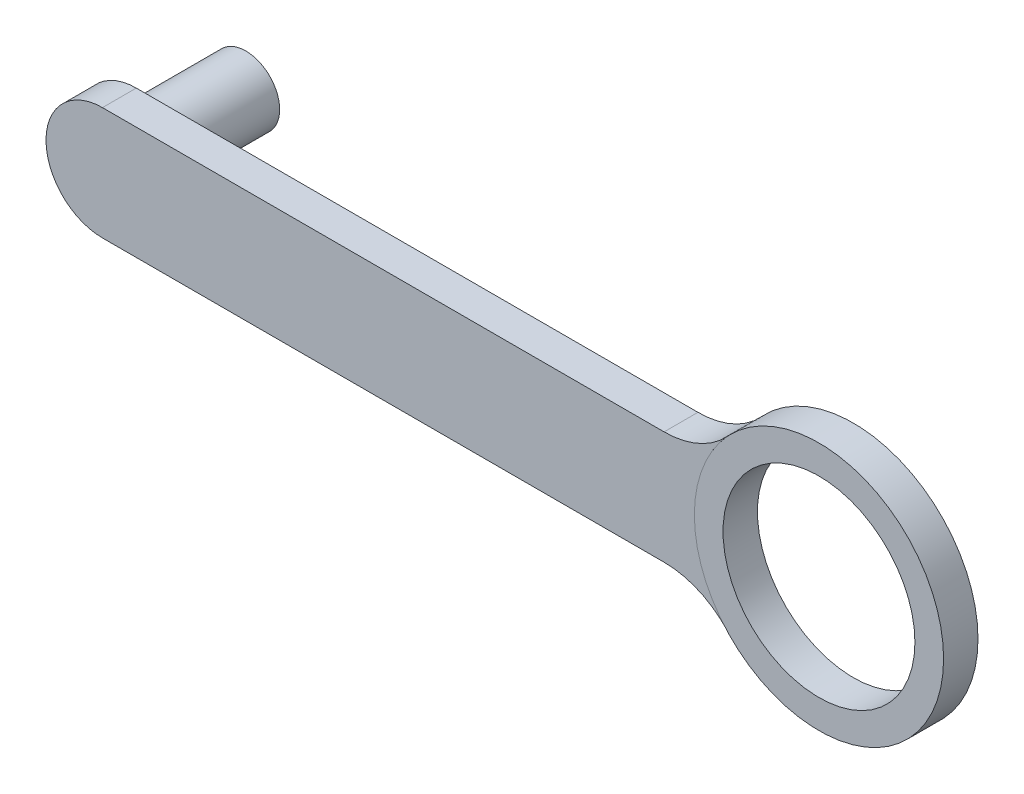
ISO-10303-21;
HEADER;
FILE_DESCRIPTION(('STEP AP214'),'2;1');
FILE_NAME('part.step','',(''),(''),'','','');
FILE_SCHEMA(('AUTOMOTIVE_DESIGN { 1 0 10303 214 1 1 1 1 }'));
ENDSEC;
DATA;
#1=APPLICATION_CONTEXT('core data for automotive mechanical design processes');
#2=APPLICATION_PROTOCOL_DEFINITION('international standard','automotive_design',2000,#1);
#3=PRODUCT_CONTEXT('',#1,'mechanical');
#4=PRODUCT('Part','Part','',(#3));
#5=PRODUCT_RELATED_PRODUCT_CATEGORY('part','',(#4));
#6=PRODUCT_DEFINITION_FORMATION('','',#4);
#7=PRODUCT_DEFINITION_CONTEXT('part definition',#1,'design');
#8=PRODUCT_DEFINITION('design','',#6,#7);
#9=PRODUCT_DEFINITION_SHAPE('','',#8);
#10=(LENGTH_UNIT() NAMED_UNIT(*) SI_UNIT(.MILLI.,.METRE.));
#11=(NAMED_UNIT(*) PLANE_ANGLE_UNIT() SI_UNIT($,.RADIAN.));
#12=(NAMED_UNIT(*) SI_UNIT($,.STERADIAN.) SOLID_ANGLE_UNIT());
#13=UNCERTAINTY_MEASURE_WITH_UNIT(LENGTH_MEASURE(1.E-05),#10,'distance_accuracy_value','');
#14=(GEOMETRIC_REPRESENTATION_CONTEXT(3) GLOBAL_UNCERTAINTY_ASSIGNED_CONTEXT((#13)) GLOBAL_UNIT_ASSIGNED_CONTEXT((#10,
#11,#12)) REPRESENTATION_CONTEXT('',''));
#15=CARTESIAN_POINT('',(0.,0.,0.));
#16=DIRECTION('',(0.,0.,1.));
#17=DIRECTION('',(1.,0.,0.));
#18=AXIS2_PLACEMENT_3D('',#15,#16,#17);
#19=CARTESIAN_POINT('',(-31.75,0.,1.5));
#20=DIRECTION('',(0.,0.,1.));
#21=DIRECTION('',(1.,0.,0.));
#22=AXIS2_PLACEMENT_3D('',#19,#20,#21);
#23=PLANE('',#22);
#24=CARTESIAN_POINT('',(31.75,0.,1.5));
#25=DIRECTION('',(0.,0.,1.));
#26=DIRECTION('',(1.,0.,0.));
#27=AXIS2_PLACEMENT_3D('',#24,#25,#26);
#28=CIRCLE('',#27,11.04);
#29=CARTESIAN_POINT('',(23.6177770705611,7.46649517684889,1.5));
#30=VERTEX_POINT('',#29);
#31=CARTESIAN_POINT('',(23.6177770705611,-7.46649517684887,1.5));
#32=VERTEX_POINT('',#31);
#33=EDGE_CURVE('E131',#30,#32,#28,.T.);
#34=ORIENTED_EDGE('',*,*,#33,.F.);
#35=CARTESIAN_POINT('',(18.0047753746983,12.62,1.5));
#36=DIRECTION('',(0.,0.,1.));
#37=DIRECTION('',(1.,0.,0.));
#38=AXIS2_PLACEMENT_3D('',#35,#36,#37);
#39=CIRCLE('',#38,7.62);
#40=CARTESIAN_POINT('',(18.0047753746983,5.00000000000002,1.5));
#41=VERTEX_POINT('',#40);
#42=EDGE_CURVE('E11',#30,#41,#39,.F.);
#43=ORIENTED_EDGE('',*,*,#42,.T.);
#44=DIRECTION('',(-1.,0.,0.));
#45=VECTOR('',#44,1.);
#46=CARTESIAN_POINT('',(-31.75,5.00000000000001,1.5));
#47=LINE('',#46,#45);
#48=CARTESIAN_POINT('',(-31.75,5.00000000000001,1.5));
#49=VERTEX_POINT('',#48);
#50=EDGE_CURVE('E95',#41,#49,#47,.T.);
#51=ORIENTED_EDGE('',*,*,#50,.T.);
#52=CARTESIAN_POINT('',(-31.75,0.,1.5));
#53=DIRECTION('',(0.,0.,1.));
#54=DIRECTION('',(1.,0.,0.));
#55=AXIS2_PLACEMENT_3D('',#52,#53,#54);
#56=CIRCLE('',#55,5.00000000000001);
#57=CARTESIAN_POINT('',(-31.75,-5.00000000000001,1.5));
#58=VERTEX_POINT('',#57);
#59=EDGE_CURVE('E96',#49,#58,#56,.T.);
#60=ORIENTED_EDGE('',*,*,#59,.T.);
#61=DIRECTION('',(1.,0.,0.));
#62=VECTOR('',#61,1.);
#63=CARTESIAN_POINT('',(-31.75,-5.00000000000001,1.5));
#64=LINE('',#63,#62);
#65=CARTESIAN_POINT('',(18.0047753746983,-5.,1.5));
#66=VERTEX_POINT('',#65);
#67=EDGE_CURVE('E85',#58,#66,#64,.T.);
#68=ORIENTED_EDGE('',*,*,#67,.T.);
#69=CARTESIAN_POINT('',(18.0047753746983,-12.62,1.5));
#70=DIRECTION('',(0.,0.,1.));
#71=DIRECTION('',(1.,0.,0.));
#72=AXIS2_PLACEMENT_3D('',#69,#70,#71);
#73=CIRCLE('',#72,7.62);
#74=EDGE_CURVE('E121',#66,#32,#73,.F.);
#75=ORIENTED_EDGE('',*,*,#74,.T.);
#76=EDGE_LOOP('',(#34,#43,#51,#60,#68,#75));
#77=FACE_BOUND('',#76,.T.);
#78=ADVANCED_FACE('F32',(#77),#23,.T.);
#79=CARTESIAN_POINT('',(-31.75,0.,-1.5));
#80=DIRECTION('',(0.,0.,1.));
#81=DIRECTION('',(1.,0.,0.));
#82=AXIS2_PLACEMENT_3D('',#79,#80,#81);
#83=PLANE('',#82);
#84=DIRECTION('',(-1.,0.,0.));
#85=VECTOR('',#84,1.);
#86=CARTESIAN_POINT('',(-31.75,5.00000000000001,-1.5));
#87=LINE('',#86,#85);
#88=CARTESIAN_POINT('',(18.0047753746983,5.00000000000002,-1.5));
#89=VERTEX_POINT('',#88);
#90=CARTESIAN_POINT('',(-31.75,5.00000000000001,-1.5));
#91=VERTEX_POINT('',#90);
#92=EDGE_CURVE('E102',#89,#91,#87,.T.);
#93=ORIENTED_EDGE('',*,*,#92,.F.);
#94=CARTESIAN_POINT('',(18.0047753746983,12.62,-1.5));
#95=DIRECTION('',(0.,0.,1.));
#96=DIRECTION('',(1.,0.,0.));
#97=AXIS2_PLACEMENT_3D('',#94,#95,#96);
#98=CIRCLE('',#97,7.62);
#99=CARTESIAN_POINT('',(23.6177770705611,7.46649517684889,-1.5));
#100=VERTEX_POINT('',#99);
#101=EDGE_CURVE('E40',#89,#100,#98,.T.);
#102=ORIENTED_EDGE('',*,*,#101,.T.);
#103=CARTESIAN_POINT('',(31.75,0.,-1.5));
#104=DIRECTION('',(0.,0.,1.));
#105=DIRECTION('',(1.,0.,0.));
#106=AXIS2_PLACEMENT_3D('',#103,#104,#105);
#107=CIRCLE('',#106,11.04);
#108=CARTESIAN_POINT('',(23.6177770705611,-7.46649517684887,-1.5));
#109=VERTEX_POINT('',#108);
#110=EDGE_CURVE('E128',#100,#109,#107,.T.);
#111=ORIENTED_EDGE('',*,*,#110,.T.);
#112=CARTESIAN_POINT('',(18.0047753746983,-12.62,-1.5));
#113=DIRECTION('',(0.,0.,1.));
#114=DIRECTION('',(1.,0.,0.));
#115=AXIS2_PLACEMENT_3D('',#112,#113,#114);
#116=CIRCLE('',#115,7.62);
#117=CARTESIAN_POINT('',(18.0047753746983,-5.,-1.5));
#118=VERTEX_POINT('',#117);
#119=EDGE_CURVE('E123',#109,#118,#116,.T.);
#120=ORIENTED_EDGE('',*,*,#119,.T.);
#121=DIRECTION('',(1.,0.,0.));
#122=VECTOR('',#121,1.);
#123=CARTESIAN_POINT('',(-31.75,-5.00000000000001,-1.5));
#124=LINE('',#123,#122);
#125=CARTESIAN_POINT('',(-31.75,-5.00000000000001,-1.5));
#126=VERTEX_POINT('',#125);
#127=EDGE_CURVE('E150',#126,#118,#124,.T.);
#128=ORIENTED_EDGE('',*,*,#127,.F.);
#129=CARTESIAN_POINT('',(-31.75,0.,-1.5));
#130=DIRECTION('',(0.,0.,1.));
#131=DIRECTION('',(1.,0.,0.));
#132=AXIS2_PLACEMENT_3D('',#129,#130,#131);
#133=CIRCLE('',#132,5.00000000000001);
#134=EDGE_CURVE('E106',#91,#126,#133,.T.);
#135=ORIENTED_EDGE('',*,*,#134,.F.);
#136=EDGE_LOOP('',(#93,#102,#111,#120,#128,#135));
#137=FACE_BOUND('',#136,.T.);
#138=CARTESIAN_POINT('',(-31.75,0.,-1.5));
#139=DIRECTION('',(0.,0.,1.));
#140=DIRECTION('',(1.,0.,0.));
#141=AXIS2_PLACEMENT_3D('',#138,#139,#140);
#142=CIRCLE('',#141,3.);
#143=CARTESIAN_POINT('',(-28.75,0.,-1.5));
#144=VERTEX_POINT('',#143);
#145=EDGE_CURVE('E145',#144,#144,#142,.T.);
#146=ORIENTED_EDGE('',*,*,#145,.T.);
#147=EDGE_LOOP('',(#146));
#148=FACE_BOUND('',#147,.T.);
#149=ADVANCED_FACE('F126',(#137,#148),#83,.F.);
#150=CARTESIAN_POINT('',(-31.75,0.,1.5));
#151=DIRECTION('',(0.,0.,-1.));
#152=DIRECTION('',(-1.,0.,0.));
#153=AXIS2_PLACEMENT_3D('',#150,#151,#152);
#154=CYLINDRICAL_SURFACE('',#153,5.00000000000001);
#155=ORIENTED_EDGE('',*,*,#134,.T.);
#156=DIRECTION('',(0.,0.,-1.));
#157=VECTOR('',#156,1.);
#158=CARTESIAN_POINT('',(-31.75,-5.00000000000001,1.5));
#159=LINE('',#158,#157);
#160=EDGE_CURVE('E90',#58,#126,#159,.T.);
#161=ORIENTED_EDGE('',*,*,#160,.F.);
#162=ORIENTED_EDGE('',*,*,#59,.F.);
#163=DIRECTION('',(0.,0.,-1.));
#164=VECTOR('',#163,1.);
#165=CARTESIAN_POINT('',(-31.75,5.00000000000001,1.5));
#166=LINE('',#165,#164);
#167=EDGE_CURVE('E107',#49,#91,#166,.T.);
#168=ORIENTED_EDGE('',*,*,#167,.T.);
#169=EDGE_LOOP('',(#155,#161,#162,#168));
#170=FACE_BOUND('',#169,.T.);
#171=ADVANCED_FACE('F104',(#170),#154,.T.);
#172=CARTESIAN_POINT('',(-31.75,-5.00000000000001,1.5));
#173=DIRECTION('',(0.,1.,0.));
#174=DIRECTION('',(-1.,0.,0.));
#175=AXIS2_PLACEMENT_3D('',#172,#173,#174);
#176=PLANE('',#175);
#177=ORIENTED_EDGE('',*,*,#127,.T.);
#178=DIRECTION('',(0.,0.,1.));
#179=VECTOR('',#178,1.);
#180=CARTESIAN_POINT('',(18.0047753746983,-5.,1.5));
#181=LINE('',#180,#179);
#182=EDGE_CURVE('E93',#118,#66,#181,.T.);
#183=ORIENTED_EDGE('',*,*,#182,.T.);
#184=ORIENTED_EDGE('',*,*,#67,.F.);
#185=ORIENTED_EDGE('',*,*,#160,.T.);
#186=EDGE_LOOP('',(#177,#183,#184,#185));
#187=FACE_BOUND('',#186,.T.);
#188=ADVANCED_FACE('F88',(#187),#176,.F.);
#189=CARTESIAN_POINT('',(-31.75,5.00000000000001,1.5));
#190=DIRECTION('',(0.,-1.,0.));
#191=DIRECTION('',(1.,0.,0.));
#192=AXIS2_PLACEMENT_3D('',#189,#190,#191);
#193=PLANE('',#192);
#194=ORIENTED_EDGE('',*,*,#50,.F.);
#195=DIRECTION('',(0.,0.,1.));
#196=VECTOR('',#195,1.);
#197=CARTESIAN_POINT('',(18.0047753746983,5.00000000000002,1.5));
#198=LINE('',#197,#196);
#199=EDGE_CURVE('E119',#41,#89,#198,.F.);
#200=ORIENTED_EDGE('',*,*,#199,.T.);
#201=ORIENTED_EDGE('',*,*,#92,.T.);
#202=ORIENTED_EDGE('',*,*,#167,.F.);
#203=EDGE_LOOP('',(#194,#200,#201,#202));
#204=FACE_BOUND('',#203,.T.);
#205=ADVANCED_FACE('F152',(#204),#193,.F.);
#206=CARTESIAN_POINT('',(-31.75,0.,-11.2));
#207=DIRECTION('',(0.,0.,1.));
#208=DIRECTION('',(1.,0.,0.));
#209=AXIS2_PLACEMENT_3D('',#206,#207,#208);
#210=CYLINDRICAL_SURFACE('',#209,3.);
#211=CARTESIAN_POINT('',(-31.75,0.,-11.2));
#212=DIRECTION('',(0.,0.,1.));
#213=DIRECTION('',(1.,0.,0.));
#214=AXIS2_PLACEMENT_3D('',#211,#212,#213);
#215=CIRCLE('',#214,3.);
#216=CARTESIAN_POINT('',(-28.75,0.,-11.2));
#217=VERTEX_POINT('',#216);
#218=EDGE_CURVE('E136',#217,#217,#215,.T.);
#219=ORIENTED_EDGE('',*,*,#218,.T.);
#220=EDGE_LOOP('',(#219));
#221=FACE_BOUND('',#220,.T.);
#222=ORIENTED_EDGE('',*,*,#145,.F.);
#223=EDGE_LOOP('',(#222));
#224=FACE_BOUND('',#223,.T.);
#225=ADVANCED_FACE('F173',(#221,#224),#210,.T.);
#226=CARTESIAN_POINT('',(-31.75,0.,-11.2));
#227=DIRECTION('',(0.,0.,1.));
#228=DIRECTION('',(1.,0.,0.));
#229=AXIS2_PLACEMENT_3D('',#226,#227,#228);
#230=PLANE('',#229);
#231=ORIENTED_EDGE('',*,*,#218,.F.);
#232=EDGE_LOOP('',(#231));
#233=FACE_BOUND('',#232,.T.);
#234=ADVANCED_FACE('F199',(#233),#230,.F.);
#235=CARTESIAN_POINT('',(31.75,0.,-1.524));
#236=DIRECTION('',(0.,0.,1.));
#237=DIRECTION('',(1.,0.,0.));
#238=AXIS2_PLACEMENT_3D('',#235,#236,#237);
#239=CYLINDRICAL_SURFACE('',#238,11.04);
#240=CARTESIAN_POINT('',(31.75,0.,1.524));
#241=DIRECTION('',(0.,0.,1.));
#242=DIRECTION('',(1.,0.,0.));
#243=AXIS2_PLACEMENT_3D('',#240,#241,#242);
#244=CIRCLE('',#243,11.04);
#245=CARTESIAN_POINT('',(42.79,0.,1.524));
#246=VERTEX_POINT('',#245);
#247=EDGE_CURVE('E139',#246,#246,#244,.T.);
#248=ORIENTED_EDGE('',*,*,#247,.F.);
#249=EDGE_LOOP('',(#248));
#250=FACE_BOUND('',#249,.T.);
#251=CARTESIAN_POINT('',(31.75,0.,-1.524));
#252=DIRECTION('',(0.,0.,1.));
#253=DIRECTION('',(1.,0.,0.));
#254=AXIS2_PLACEMENT_3D('',#251,#252,#253);
#255=CIRCLE('',#254,11.04);
#256=CARTESIAN_POINT('',(42.79,0.,-1.524));
#257=VERTEX_POINT('',#256);
#258=EDGE_CURVE('E134',#257,#257,#255,.T.);
#259=ORIENTED_EDGE('',*,*,#258,.T.);
#260=EDGE_LOOP('',(#259));
#261=FACE_BOUND('',#260,.T.);
#262=ORIENTED_EDGE('',*,*,#33,.T.);
#263=DIRECTION('',(0.,0.,1.));
#264=VECTOR('',#263,1.);
#265=CARTESIAN_POINT('',(23.6177770705611,-7.46649517684887,-1.524));
#266=LINE('',#265,#264);
#267=EDGE_CURVE('E116',#32,#109,#266,.F.);
#268=ORIENTED_EDGE('',*,*,#267,.T.);
#269=ORIENTED_EDGE('',*,*,#110,.F.);
#270=DIRECTION('',(0.,0.,1.));
#271=VECTOR('',#270,1.);
#272=CARTESIAN_POINT('',(23.6177770705611,7.46649517684889,-1.524));
#273=LINE('',#272,#271);
#274=EDGE_CURVE('E109',#100,#30,#273,.T.);
#275=ORIENTED_EDGE('',*,*,#274,.T.);
#276=EDGE_LOOP('',(#262,#268,#269,#275));
#277=FACE_BOUND('',#276,.T.);
#278=ADVANCED_FACE('F130',(#250,#261,#277),#239,.T.);
#279=CARTESIAN_POINT('',(31.75,0.,-1.524));
#280=DIRECTION('',(0.,0.,1.));
#281=DIRECTION('',(1.,0.,0.));
#282=AXIS2_PLACEMENT_3D('',#279,#280,#281);
#283=PLANE('',#282);
#284=CARTESIAN_POINT('',(31.75,0.,-1.524));
#285=DIRECTION('',(0.,0.,1.));
#286=DIRECTION('',(1.,0.,0.));
#287=AXIS2_PLACEMENT_3D('',#284,#285,#286);
#288=CIRCLE('',#287,8.5);
#289=CARTESIAN_POINT('',(40.25,0.,-1.524));
#290=VERTEX_POINT('',#289);
#291=EDGE_CURVE('E252',#290,#290,#288,.T.);
#292=ORIENTED_EDGE('',*,*,#291,.T.);
#293=EDGE_LOOP('',(#292));
#294=FACE_BOUND('',#293,.T.);
#295=ORIENTED_EDGE('',*,*,#258,.F.);
#296=EDGE_LOOP('',(#295));
#297=FACE_BOUND('',#296,.T.);
#298=ADVANCED_FACE('F162',(#294,#297),#283,.F.);
#299=CARTESIAN_POINT('',(31.75,0.,1.524));
#300=DIRECTION('',(0.,0.,1.));
#301=DIRECTION('',(1.,0.,0.));
#302=AXIS2_PLACEMENT_3D('',#299,#300,#301);
#303=PLANE('',#302);
#304=CARTESIAN_POINT('',(31.75,0.,1.524));
#305=DIRECTION('',(0.,0.,1.));
#306=DIRECTION('',(1.,0.,0.));
#307=AXIS2_PLACEMENT_3D('',#304,#305,#306);
#308=CIRCLE('',#307,8.5);
#309=CARTESIAN_POINT('',(40.25,0.,1.524));
#310=VERTEX_POINT('',#309);
#311=EDGE_CURVE('E249',#310,#310,#308,.T.);
#312=ORIENTED_EDGE('',*,*,#311,.F.);
#313=EDGE_LOOP('',(#312));
#314=FACE_BOUND('',#313,.T.);
#315=ORIENTED_EDGE('',*,*,#247,.T.);
#316=EDGE_LOOP('',(#315));
#317=FACE_BOUND('',#316,.T.);
#318=ADVANCED_FACE('F156',(#314,#317),#303,.T.);
#319=CARTESIAN_POINT('',(18.0047753746983,-12.62,-1.524));
#320=DIRECTION('',(0.,0.,1.));
#321=DIRECTION('',(1.,0.,0.));
#322=AXIS2_PLACEMENT_3D('',#319,#320,#321);
#323=CYLINDRICAL_SURFACE('',#322,7.62);
#324=ORIENTED_EDGE('',*,*,#119,.F.);
#325=ORIENTED_EDGE('',*,*,#267,.F.);
#326=ORIENTED_EDGE('',*,*,#74,.F.);
#327=ORIENTED_EDGE('',*,*,#182,.F.);
#328=EDGE_LOOP('',(#324,#325,#326,#327));
#329=FACE_BOUND('',#328,.T.);
#330=ADVANCED_FACE('F154',(#329),#323,.F.);
#331=CARTESIAN_POINT('',(18.0047753746983,12.62,-1.524));
#332=DIRECTION('',(0.,0.,1.));
#333=DIRECTION('',(1.,0.,0.));
#334=AXIS2_PLACEMENT_3D('',#331,#332,#333);
#335=CYLINDRICAL_SURFACE('',#334,7.62);
#336=ORIENTED_EDGE('',*,*,#42,.F.);
#337=ORIENTED_EDGE('',*,*,#274,.F.);
#338=ORIENTED_EDGE('',*,*,#101,.F.);
#339=ORIENTED_EDGE('',*,*,#199,.F.);
#340=EDGE_LOOP('',(#336,#337,#338,#339));
#341=FACE_BOUND('',#340,.T.);
#342=ADVANCED_FACE('F34',(#341),#335,.F.);
#343=CARTESIAN_POINT('',(31.75,0.,-11.2));
#344=DIRECTION('',(0.,0.,1.));
#345=DIRECTION('',(1.,0.,0.));
#346=AXIS2_PLACEMENT_3D('',#343,#344,#345);
#347=CYLINDRICAL_SURFACE('',#346,8.5);
#348=ORIENTED_EDGE('',*,*,#311,.T.);
#349=EDGE_LOOP('',(#348));
#350=FACE_BOUND('',#349,.T.);
#351=ORIENTED_EDGE('',*,*,#291,.F.);
#352=EDGE_LOOP('',(#351));
#353=FACE_BOUND('',#352,.T.);
#354=ADVANCED_FACE('F161',(#350,#353),#347,.F.);
#355=CLOSED_SHELL('',(#78,#149,#171,#188,#205,#225,#234,#278,#298,#318,#330,#342,#354));
#356=MANIFOLD_SOLID_BREP('B2',#355);
#357=ADVANCED_BREP_SHAPE_REPRESENTATION('',(#18,#356),#14);
#358=SHAPE_DEFINITION_REPRESENTATION(#9,#357);
ENDSEC;
END-ISO-10303-21;
